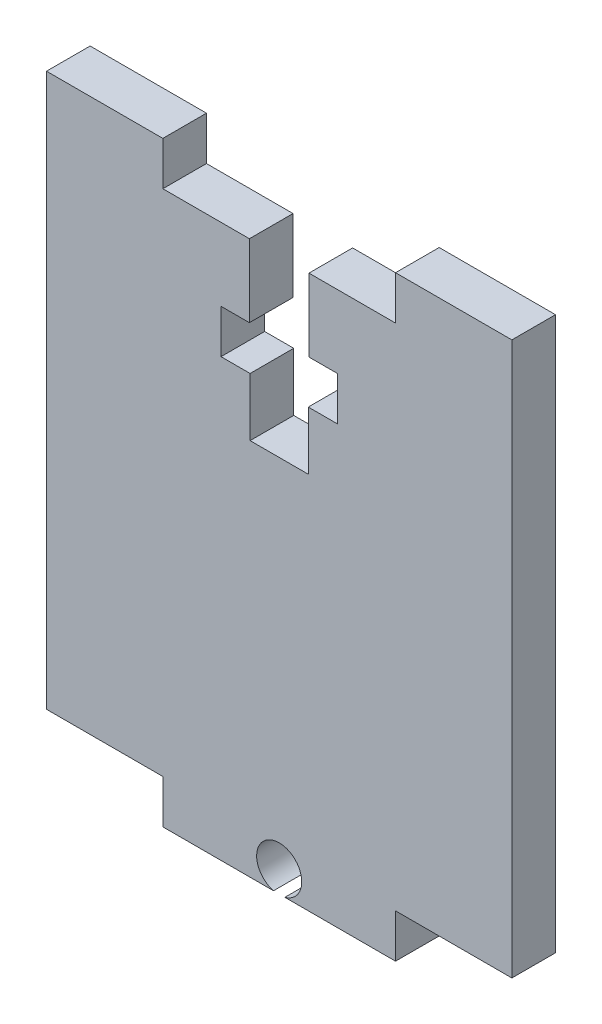
ISO-10303-21;
HEADER;
FILE_DESCRIPTION(('STEP AP214'),'2;1');
FILE_NAME('part.step','',(''),(''),'','','');
FILE_SCHEMA(('AUTOMOTIVE_DESIGN { 1 0 10303 214 1 1 1 1 }'));
ENDSEC;
DATA;
#1=APPLICATION_CONTEXT('core data for automotive mechanical design processes');
#2=APPLICATION_PROTOCOL_DEFINITION('international standard','automotive_design',2000,#1);
#3=PRODUCT_CONTEXT('',#1,'mechanical');
#4=PRODUCT('Part','Part','',(#3));
#5=PRODUCT_RELATED_PRODUCT_CATEGORY('part','',(#4));
#6=PRODUCT_DEFINITION_FORMATION('','',#4);
#7=PRODUCT_DEFINITION_CONTEXT('part definition',#1,'design');
#8=PRODUCT_DEFINITION('design','',#6,#7);
#9=PRODUCT_DEFINITION_SHAPE('','',#8);
#10=(LENGTH_UNIT() NAMED_UNIT(*) SI_UNIT(.MILLI.,.METRE.));
#11=(NAMED_UNIT(*) PLANE_ANGLE_UNIT() SI_UNIT($,.RADIAN.));
#12=(NAMED_UNIT(*) SI_UNIT($,.STERADIAN.) SOLID_ANGLE_UNIT());
#13=UNCERTAINTY_MEASURE_WITH_UNIT(LENGTH_MEASURE(1.E-05),#10,'distance_accuracy_value','');
#14=(GEOMETRIC_REPRESENTATION_CONTEXT(3) GLOBAL_UNCERTAINTY_ASSIGNED_CONTEXT((#13)) GLOBAL_UNIT_ASSIGNED_CONTEXT((#10,
#11,#12)) REPRESENTATION_CONTEXT('',''));
#15=CARTESIAN_POINT('',(0.,0.,0.));
#16=DIRECTION('',(0.,0.,1.));
#17=DIRECTION('',(1.,0.,0.));
#18=AXIS2_PLACEMENT_3D('',#15,#16,#17);
#19=CARTESIAN_POINT('',(8.,48.8553054771042,3.));
#20=DIRECTION('',(1.,0.,0.));
#21=DIRECTION('',(0.,0.,-1.));
#22=AXIS2_PLACEMENT_3D('',#19,#20,#21);
#23=PLANE('',#22);
#24=DIRECTION('',(0.,-1.,0.));
#25=VECTOR('',#24,1.);
#26=CARTESIAN_POINT('',(8.,48.8553054771042,0.));
#27=LINE('',#26,#25);
#28=CARTESIAN_POINT('',(8.,51.8553054771042,0.));
#29=VERTEX_POINT('',#28);
#30=CARTESIAN_POINT('',(8.,48.8553054771042,0.));
#31=VERTEX_POINT('',#30);
#32=EDGE_CURVE('E237',#29,#31,#27,.T.);
#33=ORIENTED_EDGE('',*,*,#32,.T.);
#34=DIRECTION('',(0.,0.,-1.));
#35=VECTOR('',#34,1.);
#36=CARTESIAN_POINT('',(8.,48.8553054771042,3.));
#37=LINE('',#36,#35);
#38=CARTESIAN_POINT('',(8.,48.8553054771042,3.));
#39=VERTEX_POINT('',#38);
#40=EDGE_CURVE('E11',#39,#31,#37,.T.);
#41=ORIENTED_EDGE('',*,*,#40,.F.);
#42=DIRECTION('',(0.,-1.,0.));
#43=VECTOR('',#42,1.);
#44=CARTESIAN_POINT('',(8.,48.8553054771042,3.));
#45=LINE('',#44,#43);
#46=CARTESIAN_POINT('',(8.,51.8553054771042,3.));
#47=VERTEX_POINT('',#46);
#48=EDGE_CURVE('E287',#47,#39,#45,.T.);
#49=ORIENTED_EDGE('',*,*,#48,.F.);
#50=DIRECTION('',(0.,0.,-1.));
#51=VECTOR('',#50,1.);
#52=CARTESIAN_POINT('',(8.,51.8553054771042,3.));
#53=LINE('',#52,#51);
#54=EDGE_CURVE('E233',#47,#29,#53,.T.);
#55=ORIENTED_EDGE('',*,*,#54,.T.);
#56=EDGE_LOOP('',(#33,#41,#49,#55));
#57=FACE_BOUND('',#56,.T.);
#58=ADVANCED_FACE('F33',(#57),#23,.F.);
#59=CARTESIAN_POINT('',(2.04789002341845,48.8553054771042,3.));
#60=DIRECTION('',(0.,-1.,0.));
#61=DIRECTION('',(0.,0.,-1.));
#62=AXIS2_PLACEMENT_3D('',#59,#60,#61);
#63=PLANE('',#62);
#64=DIRECTION('',(-1.,0.,0.));
#65=VECTOR('',#64,1.);
#66=CARTESIAN_POINT('',(2.04789002341845,48.8553054771042,0.));
#67=LINE('',#66,#65);
#68=CARTESIAN_POINT('',(2.04789002341845,48.8553054771042,0.));
#69=VERTEX_POINT('',#68);
#70=EDGE_CURVE('E240',#31,#69,#67,.T.);
#71=ORIENTED_EDGE('',*,*,#70,.T.);
#72=DIRECTION('',(0.,0.,-1.));
#73=VECTOR('',#72,1.);
#74=CARTESIAN_POINT('',(2.04789002341845,48.8553054771042,3.));
#75=LINE('',#74,#73);
#76=CARTESIAN_POINT('',(2.04789002341845,48.8553054771042,3.));
#77=VERTEX_POINT('',#76);
#78=EDGE_CURVE('E41',#77,#69,#75,.T.);
#79=ORIENTED_EDGE('',*,*,#78,.F.);
#80=DIRECTION('',(-1.,0.,0.));
#81=VECTOR('',#80,1.);
#82=CARTESIAN_POINT('',(2.04789002341845,48.8553054771042,3.));
#83=LINE('',#82,#81);
#84=EDGE_CURVE('E146',#39,#77,#83,.T.);
#85=ORIENTED_EDGE('',*,*,#84,.F.);
#86=ORIENTED_EDGE('',*,*,#40,.T.);
#87=EDGE_LOOP('',(#71,#79,#85,#86));
#88=FACE_BOUND('',#87,.T.);
#89=ADVANCED_FACE('F435',(#88),#63,.F.);
#90=CARTESIAN_POINT('',(2.04789002341845,48.8553054771042,3.));
#91=DIRECTION('',(1.,0.,0.));
#92=DIRECTION('',(0.,1.,0.));
#93=AXIS2_PLACEMENT_3D('',#90,#91,#92);
#94=PLANE('',#93);
#95=DIRECTION('',(0.,-1.,0.));
#96=VECTOR('',#95,1.);
#97=CARTESIAN_POINT('',(2.04789002341845,48.8553054771042,0.));
#98=LINE('',#97,#96);
#99=CARTESIAN_POINT('',(2.04789002341845,43.8553054771042,0.));
#100=VERTEX_POINT('',#99);
#101=EDGE_CURVE('E242',#69,#100,#98,.T.);
#102=ORIENTED_EDGE('',*,*,#101,.T.);
#103=DIRECTION('',(0.,0.,-1.));
#104=VECTOR('',#103,1.);
#105=CARTESIAN_POINT('',(2.04789002341845,43.8553054771042,3.));
#106=LINE('',#105,#104);
#107=CARTESIAN_POINT('',(2.04789002341845,43.8553054771042,3.));
#108=VERTEX_POINT('',#107);
#109=EDGE_CURVE('E348',#108,#100,#106,.T.);
#110=ORIENTED_EDGE('',*,*,#109,.F.);
#111=DIRECTION('',(0.,-1.,0.));
#112=VECTOR('',#111,1.);
#113=CARTESIAN_POINT('',(2.04789002341845,48.8553054771042,3.));
#114=LINE('',#113,#112);
#115=EDGE_CURVE('E356',#77,#108,#114,.T.);
#116=ORIENTED_EDGE('',*,*,#115,.F.);
#117=ORIENTED_EDGE('',*,*,#78,.T.);
#118=EDGE_LOOP('',(#102,#110,#116,#117));
#119=FACE_BOUND('',#118,.T.);
#120=ADVANCED_FACE('F354',(#119),#94,.F.);
#121=CARTESIAN_POINT('',(2.04789002341845,43.8553054771042,3.));
#122=DIRECTION('',(0.,1.,0.));
#123=DIRECTION('',(-1.,0.,0.));
#124=AXIS2_PLACEMENT_3D('',#121,#122,#123);
#125=PLANE('',#124);
#126=DIRECTION('',(1.,0.,0.));
#127=VECTOR('',#126,1.);
#128=CARTESIAN_POINT('',(2.04789002341845,43.8553054771042,0.));
#129=LINE('',#128,#127);
#130=CARTESIAN_POINT('',(4.,43.8553054771042,0.));
#131=VERTEX_POINT('',#130);
#132=EDGE_CURVE('E244',#100,#131,#129,.T.);
#133=ORIENTED_EDGE('',*,*,#132,.T.);
#134=DIRECTION('',(0.,0.,-1.));
#135=VECTOR('',#134,1.);
#136=CARTESIAN_POINT('',(4.,43.8553054771042,3.));
#137=LINE('',#136,#135);
#138=CARTESIAN_POINT('',(4.,43.8553054771042,3.));
#139=VERTEX_POINT('',#138);
#140=EDGE_CURVE('E345',#139,#131,#137,.T.);
#141=ORIENTED_EDGE('',*,*,#140,.F.);
#142=DIRECTION('',(1.,0.,0.));
#143=VECTOR('',#142,1.);
#144=CARTESIAN_POINT('',(2.04789002341845,43.8553054771042,3.));
#145=LINE('',#144,#143);
#146=EDGE_CURVE('E374',#108,#139,#145,.T.);
#147=ORIENTED_EDGE('',*,*,#146,.F.);
#148=ORIENTED_EDGE('',*,*,#109,.T.);
#149=EDGE_LOOP('',(#133,#141,#147,#148));
#150=FACE_BOUND('',#149,.T.);
#151=ADVANCED_FACE('F365',(#150),#125,.F.);
#152=CARTESIAN_POINT('',(4.,43.8553054771042,3.));
#153=DIRECTION('',(1.,0.,0.));
#154=DIRECTION('',(0.,1.,0.));
#155=AXIS2_PLACEMENT_3D('',#152,#153,#154);
#156=PLANE('',#155);
#157=DIRECTION('',(0.,-1.,0.));
#158=VECTOR('',#157,1.);
#159=CARTESIAN_POINT('',(4.,43.8553054771042,0.));
#160=LINE('',#159,#158);
#161=CARTESIAN_POINT('',(4.,40.8553054771042,0.));
#162=VERTEX_POINT('',#161);
#163=EDGE_CURVE('E246',#131,#162,#160,.T.);
#164=ORIENTED_EDGE('',*,*,#163,.T.);
#165=DIRECTION('',(0.,0.,-1.));
#166=VECTOR('',#165,1.);
#167=CARTESIAN_POINT('',(4.,40.8553054771042,3.));
#168=LINE('',#167,#166);
#169=CARTESIAN_POINT('',(4.,40.8553054771042,3.));
#170=VERTEX_POINT('',#169);
#171=EDGE_CURVE('E342',#170,#162,#168,.T.);
#172=ORIENTED_EDGE('',*,*,#171,.F.);
#173=DIRECTION('',(0.,-1.,0.));
#174=VECTOR('',#173,1.);
#175=CARTESIAN_POINT('',(4.,43.8553054771042,3.));
#176=LINE('',#175,#174);
#177=EDGE_CURVE('E371',#139,#170,#176,.T.);
#178=ORIENTED_EDGE('',*,*,#177,.F.);
#179=ORIENTED_EDGE('',*,*,#140,.T.);
#180=EDGE_LOOP('',(#164,#172,#178,#179));
#181=FACE_BOUND('',#180,.T.);
#182=ADVANCED_FACE('F369',(#181),#156,.F.);
#183=CARTESIAN_POINT('',(4.,40.8553054771042,3.));
#184=DIRECTION('',(0.,-1.,0.));
#185=DIRECTION('',(0.,0.,-1.));
#186=AXIS2_PLACEMENT_3D('',#183,#184,#185);
#187=PLANE('',#186);
#188=DIRECTION('',(-1.,0.,0.));
#189=VECTOR('',#188,1.);
#190=CARTESIAN_POINT('',(4.,40.8553054771042,0.));
#191=LINE('',#190,#189);
#192=CARTESIAN_POINT('',(2.,40.8553054771042,0.));
#193=VERTEX_POINT('',#192);
#194=EDGE_CURVE('E248',#162,#193,#191,.T.);
#195=ORIENTED_EDGE('',*,*,#194,.T.);
#196=DIRECTION('',(0.,0.,-1.));
#197=VECTOR('',#196,1.);
#198=CARTESIAN_POINT('',(2.,40.8553054771042,3.));
#199=LINE('',#198,#197);
#200=CARTESIAN_POINT('',(2.,40.8553054771042,3.));
#201=VERTEX_POINT('',#200);
#202=EDGE_CURVE('E339',#201,#193,#199,.T.);
#203=ORIENTED_EDGE('',*,*,#202,.F.);
#204=DIRECTION('',(-1.,0.,0.));
#205=VECTOR('',#204,1.);
#206=CARTESIAN_POINT('',(4.,40.8553054771042,3.));
#207=LINE('',#206,#205);
#208=EDGE_CURVE('E373',#170,#201,#207,.T.);
#209=ORIENTED_EDGE('',*,*,#208,.F.);
#210=ORIENTED_EDGE('',*,*,#171,.T.);
#211=EDGE_LOOP('',(#195,#203,#209,#210));
#212=FACE_BOUND('',#211,.T.);
#213=ADVANCED_FACE('F448',(#212),#187,.F.);
#214=CARTESIAN_POINT('',(2.,40.8553054771042,3.));
#215=DIRECTION('',(1.,0.,0.));
#216=DIRECTION('',(0.,1.,0.));
#217=AXIS2_PLACEMENT_3D('',#214,#215,#216);
#218=PLANE('',#217);
#219=DIRECTION('',(0.,-1.,0.));
#220=VECTOR('',#219,1.);
#221=CARTESIAN_POINT('',(2.,40.8553054771042,0.));
#222=LINE('',#221,#220);
#223=CARTESIAN_POINT('',(2.,36.8553054771042,0.));
#224=VERTEX_POINT('',#223);
#225=EDGE_CURVE('E250',#193,#224,#222,.T.);
#226=ORIENTED_EDGE('',*,*,#225,.T.);
#227=DIRECTION('',(0.,0.,-1.));
#228=VECTOR('',#227,1.);
#229=CARTESIAN_POINT('',(2.,36.8553054771042,3.));
#230=LINE('',#229,#228);
#231=CARTESIAN_POINT('',(2.,36.8553054771042,3.));
#232=VERTEX_POINT('',#231);
#233=EDGE_CURVE('E336',#232,#224,#230,.T.);
#234=ORIENTED_EDGE('',*,*,#233,.F.);
#235=DIRECTION('',(0.,-1.,0.));
#236=VECTOR('',#235,1.);
#237=CARTESIAN_POINT('',(2.,40.8553054771042,3.));
#238=LINE('',#237,#236);
#239=EDGE_CURVE('E376',#201,#232,#238,.T.);
#240=ORIENTED_EDGE('',*,*,#239,.F.);
#241=ORIENTED_EDGE('',*,*,#202,.T.);
#242=EDGE_LOOP('',(#226,#234,#240,#241));
#243=FACE_BOUND('',#242,.T.);
#244=ADVANCED_FACE('F451',(#243),#218,.F.);
#245=CARTESIAN_POINT('',(2.,36.8553054771042,3.));
#246=DIRECTION('',(0.,-1.,0.));
#247=DIRECTION('',(0.,0.,-1.));
#248=AXIS2_PLACEMENT_3D('',#245,#246,#247);
#249=PLANE('',#248);
#250=DIRECTION('',(-1.,0.,0.));
#251=VECTOR('',#250,1.);
#252=CARTESIAN_POINT('',(2.,36.8553054771042,0.));
#253=LINE('',#252,#251);
#254=CARTESIAN_POINT('',(-2.,36.8553054771042,0.));
#255=VERTEX_POINT('',#254);
#256=EDGE_CURVE('E252',#224,#255,#253,.T.);
#257=ORIENTED_EDGE('',*,*,#256,.T.);
#258=DIRECTION('',(0.,0.,-1.));
#259=VECTOR('',#258,1.);
#260=CARTESIAN_POINT('',(-2.,36.8553054771042,3.));
#261=LINE('',#260,#259);
#262=CARTESIAN_POINT('',(-2.,36.8553054771042,3.));
#263=VERTEX_POINT('',#262);
#264=EDGE_CURVE('E333',#263,#255,#261,.T.);
#265=ORIENTED_EDGE('',*,*,#264,.F.);
#266=DIRECTION('',(-1.,0.,0.));
#267=VECTOR('',#266,1.);
#268=CARTESIAN_POINT('',(2.,36.8553054771042,3.));
#269=LINE('',#268,#267);
#270=EDGE_CURVE('E382',#232,#263,#269,.T.);
#271=ORIENTED_EDGE('',*,*,#270,.F.);
#272=ORIENTED_EDGE('',*,*,#233,.T.);
#273=EDGE_LOOP('',(#257,#265,#271,#272));
#274=FACE_BOUND('',#273,.T.);
#275=ADVANCED_FACE('F455',(#274),#249,.F.);
#276=CARTESIAN_POINT('',(-2.,40.8553054771042,3.));
#277=DIRECTION('',(-1.,0.,0.));
#278=DIRECTION('',(0.,-1.,0.));
#279=AXIS2_PLACEMENT_3D('',#276,#277,#278);
#280=PLANE('',#279);
#281=DIRECTION('',(0.,1.,0.));
#282=VECTOR('',#281,1.);
#283=CARTESIAN_POINT('',(-2.,40.8553054771042,0.));
#284=LINE('',#283,#282);
#285=CARTESIAN_POINT('',(-2.,40.8553054771042,0.));
#286=VERTEX_POINT('',#285);
#287=EDGE_CURVE('E254',#255,#286,#284,.T.);
#288=ORIENTED_EDGE('',*,*,#287,.T.);
#289=DIRECTION('',(0.,0.,-1.));
#290=VECTOR('',#289,1.);
#291=CARTESIAN_POINT('',(-2.,40.8553054771042,3.));
#292=LINE('',#291,#290);
#293=CARTESIAN_POINT('',(-2.,40.8553054771042,3.));
#294=VERTEX_POINT('',#293);
#295=EDGE_CURVE('E330',#294,#286,#292,.T.);
#296=ORIENTED_EDGE('',*,*,#295,.F.);
#297=DIRECTION('',(0.,1.,0.));
#298=VECTOR('',#297,1.);
#299=CARTESIAN_POINT('',(-2.,40.8553054771042,3.));
#300=LINE('',#299,#298);
#301=EDGE_CURVE('E384',#263,#294,#300,.T.);
#302=ORIENTED_EDGE('',*,*,#301,.F.);
#303=ORIENTED_EDGE('',*,*,#264,.T.);
#304=EDGE_LOOP('',(#288,#296,#302,#303));
#305=FACE_BOUND('',#304,.T.);
#306=ADVANCED_FACE('F459',(#305),#280,.F.);
#307=CARTESIAN_POINT('',(-4.00000000000001,40.8553054771042,3.));
#308=DIRECTION('',(0.,-1.,0.));
#309=DIRECTION('',(0.,0.,-1.));
#310=AXIS2_PLACEMENT_3D('',#307,#308,#309);
#311=PLANE('',#310);
#312=DIRECTION('',(-1.,0.,0.));
#313=VECTOR('',#312,1.);
#314=CARTESIAN_POINT('',(-4.00000000000001,40.8553054771042,0.));
#315=LINE('',#314,#313);
#316=CARTESIAN_POINT('',(-4.00000000000001,40.8553054771042,0.));
#317=VERTEX_POINT('',#316);
#318=EDGE_CURVE('E256',#286,#317,#315,.T.);
#319=ORIENTED_EDGE('',*,*,#318,.T.);
#320=DIRECTION('',(0.,0.,-1.));
#321=VECTOR('',#320,1.);
#322=CARTESIAN_POINT('',(-4.00000000000001,40.8553054771042,3.));
#323=LINE('',#322,#321);
#324=CARTESIAN_POINT('',(-4.00000000000001,40.8553054771042,3.));
#325=VERTEX_POINT('',#324);
#326=EDGE_CURVE('E327',#325,#317,#323,.T.);
#327=ORIENTED_EDGE('',*,*,#326,.F.);
#328=DIRECTION('',(-1.,0.,0.));
#329=VECTOR('',#328,1.);
#330=CARTESIAN_POINT('',(-4.00000000000001,40.8553054771042,3.));
#331=LINE('',#330,#329);
#332=EDGE_CURVE('E386',#294,#325,#331,.T.);
#333=ORIENTED_EDGE('',*,*,#332,.F.);
#334=ORIENTED_EDGE('',*,*,#295,.T.);
#335=EDGE_LOOP('',(#319,#327,#333,#334));
#336=FACE_BOUND('',#335,.T.);
#337=ADVANCED_FACE('F463',(#336),#311,.F.);
#338=CARTESIAN_POINT('',(-4.,43.8553054771042,3.));
#339=DIRECTION('',(-1.,0.,0.));
#340=DIRECTION('',(0.,-1.,0.));
#341=AXIS2_PLACEMENT_3D('',#338,#339,#340);
#342=PLANE('',#341);
#343=DIRECTION('',(0.,1.,0.));
#344=VECTOR('',#343,1.);
#345=CARTESIAN_POINT('',(-4.,43.8553054771042,0.));
#346=LINE('',#345,#344);
#347=CARTESIAN_POINT('',(-4.,43.8553054771042,0.));
#348=VERTEX_POINT('',#347);
#349=EDGE_CURVE('E258',#317,#348,#346,.T.);
#350=ORIENTED_EDGE('',*,*,#349,.T.);
#351=DIRECTION('',(0.,0.,-1.));
#352=VECTOR('',#351,1.);
#353=CARTESIAN_POINT('',(-4.,43.8553054771042,3.));
#354=LINE('',#353,#352);
#355=CARTESIAN_POINT('',(-4.,43.8553054771042,3.));
#356=VERTEX_POINT('',#355);
#357=EDGE_CURVE('E324',#356,#348,#354,.T.);
#358=ORIENTED_EDGE('',*,*,#357,.F.);
#359=DIRECTION('',(0.,1.,0.));
#360=VECTOR('',#359,1.);
#361=CARTESIAN_POINT('',(-4.,43.8553054771042,3.));
#362=LINE('',#361,#360);
#363=EDGE_CURVE('E388',#325,#356,#362,.T.);
#364=ORIENTED_EDGE('',*,*,#363,.F.);
#365=ORIENTED_EDGE('',*,*,#326,.T.);
#366=EDGE_LOOP('',(#350,#358,#364,#365));
#367=FACE_BOUND('',#366,.T.);
#368=ADVANCED_FACE('F467',(#367),#342,.F.);
#369=CARTESIAN_POINT('',(-2.04789002341846,43.8553054771042,3.));
#370=DIRECTION('',(0.,1.,0.));
#371=DIRECTION('',(-1.,0.,0.));
#372=AXIS2_PLACEMENT_3D('',#369,#370,#371);
#373=PLANE('',#372);
#374=DIRECTION('',(1.,0.,0.));
#375=VECTOR('',#374,1.);
#376=CARTESIAN_POINT('',(-2.04789002341846,43.8553054771042,0.));
#377=LINE('',#376,#375);
#378=CARTESIAN_POINT('',(-2.04789002341846,43.8553054771042,0.));
#379=VERTEX_POINT('',#378);
#380=EDGE_CURVE('E260',#348,#379,#377,.T.);
#381=ORIENTED_EDGE('',*,*,#380,.T.);
#382=DIRECTION('',(0.,0.,-1.));
#383=VECTOR('',#382,1.);
#384=CARTESIAN_POINT('',(-2.04789002341846,43.8553054771042,3.));
#385=LINE('',#384,#383);
#386=CARTESIAN_POINT('',(-2.04789002341846,43.8553054771042,3.));
#387=VERTEX_POINT('',#386);
#388=EDGE_CURVE('E321',#387,#379,#385,.T.);
#389=ORIENTED_EDGE('',*,*,#388,.F.);
#390=DIRECTION('',(1.,0.,0.));
#391=VECTOR('',#390,1.);
#392=CARTESIAN_POINT('',(-2.04789002341846,43.8553054771042,3.));
#393=LINE('',#392,#391);
#394=EDGE_CURVE('E390',#356,#387,#393,.T.);
#395=ORIENTED_EDGE('',*,*,#394,.F.);
#396=ORIENTED_EDGE('',*,*,#357,.T.);
#397=EDGE_LOOP('',(#381,#389,#395,#396));
#398=FACE_BOUND('',#397,.T.);
#399=ADVANCED_FACE('F471',(#398),#373,.F.);
#400=CARTESIAN_POINT('',(-2.04789002341846,48.8553054771042,3.));
#401=DIRECTION('',(-1.,0.,0.));
#402=DIRECTION('',(0.,-1.,0.));
#403=AXIS2_PLACEMENT_3D('',#400,#401,#402);
#404=PLANE('',#403);
#405=DIRECTION('',(0.,1.,0.));
#406=VECTOR('',#405,1.);
#407=CARTESIAN_POINT('',(-2.04789002341846,48.8553054771042,0.));
#408=LINE('',#407,#406);
#409=CARTESIAN_POINT('',(-2.04789002341846,48.8553054771042,0.));
#410=VERTEX_POINT('',#409);
#411=EDGE_CURVE('E262',#379,#410,#408,.T.);
#412=ORIENTED_EDGE('',*,*,#411,.T.);
#413=DIRECTION('',(0.,0.,-1.));
#414=VECTOR('',#413,1.);
#415=CARTESIAN_POINT('',(-2.04789002341846,48.8553054771042,3.));
#416=LINE('',#415,#414);
#417=CARTESIAN_POINT('',(-2.04789002341846,48.8553054771042,3.));
#418=VERTEX_POINT('',#417);
#419=EDGE_CURVE('E318',#418,#410,#416,.T.);
#420=ORIENTED_EDGE('',*,*,#419,.F.);
#421=DIRECTION('',(0.,1.,0.));
#422=VECTOR('',#421,1.);
#423=CARTESIAN_POINT('',(-2.04789002341846,48.8553054771042,3.));
#424=LINE('',#423,#422);
#425=EDGE_CURVE('E392',#387,#418,#424,.T.);
#426=ORIENTED_EDGE('',*,*,#425,.F.);
#427=ORIENTED_EDGE('',*,*,#388,.T.);
#428=EDGE_LOOP('',(#412,#420,#426,#427));
#429=FACE_BOUND('',#428,.T.);
#430=ADVANCED_FACE('F475',(#429),#404,.F.);
#431=CARTESIAN_POINT('',(-2.04789002341846,48.8553054771042,3.));
#432=DIRECTION('',(0.,-1.,0.));
#433=DIRECTION('',(0.,0.,-1.));
#434=AXIS2_PLACEMENT_3D('',#431,#432,#433);
#435=PLANE('',#434);
#436=DIRECTION('',(-1.,0.,0.));
#437=VECTOR('',#436,1.);
#438=CARTESIAN_POINT('',(-2.04789002341846,48.8553054771042,0.));
#439=LINE('',#438,#437);
#440=CARTESIAN_POINT('',(-8.00000000000001,48.8553054771042,0.));
#441=VERTEX_POINT('',#440);
#442=EDGE_CURVE('E264',#410,#441,#439,.T.);
#443=ORIENTED_EDGE('',*,*,#442,.T.);
#444=DIRECTION('',(0.,0.,-1.));
#445=VECTOR('',#444,1.);
#446=CARTESIAN_POINT('',(-8.00000000000001,48.8553054771042,3.));
#447=LINE('',#446,#445);
#448=CARTESIAN_POINT('',(-8.00000000000001,48.8553054771042,3.));
#449=VERTEX_POINT('',#448);
#450=EDGE_CURVE('E315',#449,#441,#447,.T.);
#451=ORIENTED_EDGE('',*,*,#450,.F.);
#452=DIRECTION('',(-1.,0.,0.));
#453=VECTOR('',#452,1.);
#454=CARTESIAN_POINT('',(-2.04789002341846,48.8553054771042,3.));
#455=LINE('',#454,#453);
#456=EDGE_CURVE('E394',#418,#449,#455,.T.);
#457=ORIENTED_EDGE('',*,*,#456,.F.);
#458=ORIENTED_EDGE('',*,*,#419,.T.);
#459=EDGE_LOOP('',(#443,#451,#457,#458));
#460=FACE_BOUND('',#459,.T.);
#461=ADVANCED_FACE('F479',(#460),#435,.F.);
#462=CARTESIAN_POINT('',(-8.00000000000001,48.8553054771042,3.));
#463=DIRECTION('',(-1.,0.,0.));
#464=DIRECTION('',(0.,0.,1.));
#465=AXIS2_PLACEMENT_3D('',#462,#463,#464);
#466=PLANE('',#465);
#467=DIRECTION('',(0.,1.,0.));
#468=VECTOR('',#467,1.);
#469=CARTESIAN_POINT('',(-8.00000000000001,48.8553054771042,0.));
#470=LINE('',#469,#468);
#471=CARTESIAN_POINT('',(-8.00000000000001,51.8553054771042,0.));
#472=VERTEX_POINT('',#471);
#473=EDGE_CURVE('E266',#441,#472,#470,.T.);
#474=ORIENTED_EDGE('',*,*,#473,.T.);
#475=DIRECTION('',(0.,0.,-1.));
#476=VECTOR('',#475,1.);
#477=CARTESIAN_POINT('',(-8.00000000000001,51.8553054771042,3.));
#478=LINE('',#477,#476);
#479=CARTESIAN_POINT('',(-8.00000000000001,51.8553054771042,3.));
#480=VERTEX_POINT('',#479);
#481=EDGE_CURVE('E312',#480,#472,#478,.T.);
#482=ORIENTED_EDGE('',*,*,#481,.F.);
#483=DIRECTION('',(0.,1.,0.));
#484=VECTOR('',#483,1.);
#485=CARTESIAN_POINT('',(-8.00000000000001,48.8553054771042,3.));
#486=LINE('',#485,#484);
#487=EDGE_CURVE('E396',#449,#480,#486,.T.);
#488=ORIENTED_EDGE('',*,*,#487,.F.);
#489=ORIENTED_EDGE('',*,*,#450,.T.);
#490=EDGE_LOOP('',(#474,#482,#488,#489));
#491=FACE_BOUND('',#490,.T.);
#492=ADVANCED_FACE('F483',(#491),#466,.F.);
#493=CARTESIAN_POINT('',(-8.00000000000001,51.8553054771042,3.));
#494=DIRECTION('',(0.,-1.,0.));
#495=DIRECTION('',(0.,0.,-1.));
#496=AXIS2_PLACEMENT_3D('',#493,#494,#495);
#497=PLANE('',#496);
#498=DIRECTION('',(-1.,0.,0.));
#499=VECTOR('',#498,1.);
#500=CARTESIAN_POINT('',(-8.00000000000001,51.8553054771042,0.));
#501=LINE('',#500,#499);
#502=CARTESIAN_POINT('',(-16.,51.8553054771042,0.));
#503=VERTEX_POINT('',#502);
#504=EDGE_CURVE('E268',#472,#503,#501,.T.);
#505=ORIENTED_EDGE('',*,*,#504,.T.);
#506=DIRECTION('',(0.,0.,-1.));
#507=VECTOR('',#506,1.);
#508=CARTESIAN_POINT('',(-16.,51.8553054771042,3.));
#509=LINE('',#508,#507);
#510=CARTESIAN_POINT('',(-16.,51.8553054771042,3.));
#511=VERTEX_POINT('',#510);
#512=EDGE_CURVE('E309',#511,#503,#509,.T.);
#513=ORIENTED_EDGE('',*,*,#512,.F.);
#514=DIRECTION('',(-1.,0.,0.));
#515=VECTOR('',#514,1.);
#516=CARTESIAN_POINT('',(-8.00000000000001,51.8553054771042,3.));
#517=LINE('',#516,#515);
#518=EDGE_CURVE('E398',#480,#511,#517,.T.);
#519=ORIENTED_EDGE('',*,*,#518,.F.);
#520=ORIENTED_EDGE('',*,*,#481,.T.);
#521=EDGE_LOOP('',(#505,#513,#519,#520));
#522=FACE_BOUND('',#521,.T.);
#523=ADVANCED_FACE('F487',(#522),#497,.F.);
#524=CARTESIAN_POINT('',(-16.,51.8553054771042,3.));
#525=DIRECTION('',(1.,0.,0.));
#526=DIRECTION('',(0.,1.,0.));
#527=AXIS2_PLACEMENT_3D('',#524,#525,#526);
#528=PLANE('',#527);
#529=DIRECTION('',(0.,-1.,0.));
#530=VECTOR('',#529,1.);
#531=CARTESIAN_POINT('',(-16.,51.8553054771042,0.));
#532=LINE('',#531,#530);
#533=CARTESIAN_POINT('',(-16.,13.8553054771042,0.));
#534=VERTEX_POINT('',#533);
#535=EDGE_CURVE('E270',#503,#534,#532,.T.);
#536=ORIENTED_EDGE('',*,*,#535,.T.);
#537=DIRECTION('',(0.,0.,-1.));
#538=VECTOR('',#537,1.);
#539=CARTESIAN_POINT('',(-16.,13.8553054771042,3.));
#540=LINE('',#539,#538);
#541=CARTESIAN_POINT('',(-16.,13.8553054771042,3.));
#542=VERTEX_POINT('',#541);
#543=EDGE_CURVE('E306',#542,#534,#540,.T.);
#544=ORIENTED_EDGE('',*,*,#543,.F.);
#545=DIRECTION('',(0.,-1.,0.));
#546=VECTOR('',#545,1.);
#547=CARTESIAN_POINT('',(-16.,51.8553054771042,3.));
#548=LINE('',#547,#546);
#549=EDGE_CURVE('E400',#511,#542,#548,.T.);
#550=ORIENTED_EDGE('',*,*,#549,.F.);
#551=ORIENTED_EDGE('',*,*,#512,.T.);
#552=EDGE_LOOP('',(#536,#544,#550,#551));
#553=FACE_BOUND('',#552,.T.);
#554=ADVANCED_FACE('F491',(#553),#528,.F.);
#555=CARTESIAN_POINT('',(-16.,13.8553054771042,3.));
#556=DIRECTION('',(0.,1.,0.));
#557=DIRECTION('',(-1.,0.,0.));
#558=AXIS2_PLACEMENT_3D('',#555,#556,#557);
#559=PLANE('',#558);
#560=DIRECTION('',(1.,0.,0.));
#561=VECTOR('',#560,1.);
#562=CARTESIAN_POINT('',(-16.,13.8553054771042,0.));
#563=LINE('',#562,#561);
#564=CARTESIAN_POINT('',(-8.00000000000001,13.8553054771042,0.));
#565=VERTEX_POINT('',#564);
#566=EDGE_CURVE('E272',#534,#565,#563,.T.);
#567=ORIENTED_EDGE('',*,*,#566,.T.);
#568=DIRECTION('',(0.,0.,-1.));
#569=VECTOR('',#568,1.);
#570=CARTESIAN_POINT('',(-8.00000000000001,13.8553054771042,3.));
#571=LINE('',#570,#569);
#572=CARTESIAN_POINT('',(-8.00000000000001,13.8553054771042,3.));
#573=VERTEX_POINT('',#572);
#574=EDGE_CURVE('E303',#573,#565,#571,.T.);
#575=ORIENTED_EDGE('',*,*,#574,.F.);
#576=DIRECTION('',(1.,0.,0.));
#577=VECTOR('',#576,1.);
#578=CARTESIAN_POINT('',(-16.,13.8553054771042,3.));
#579=LINE('',#578,#577);
#580=EDGE_CURVE('E402',#542,#573,#579,.T.);
#581=ORIENTED_EDGE('',*,*,#580,.F.);
#582=ORIENTED_EDGE('',*,*,#543,.T.);
#583=EDGE_LOOP('',(#567,#575,#581,#582));
#584=FACE_BOUND('',#583,.T.);
#585=ADVANCED_FACE('F495',(#584),#559,.F.);
#586=CARTESIAN_POINT('',(-8.00000000000001,10.8553054771042,3.));
#587=DIRECTION('',(1.,0.,0.));
#588=DIRECTION('',(0.,1.,0.));
#589=AXIS2_PLACEMENT_3D('',#586,#587,#588);
#590=PLANE('',#589);
#591=DIRECTION('',(0.,-1.,0.));
#592=VECTOR('',#591,1.);
#593=CARTESIAN_POINT('',(-8.00000000000001,10.8553054771042,0.));
#594=LINE('',#593,#592);
#595=CARTESIAN_POINT('',(-8.00000000000001,10.8553054771042,0.));
#596=VERTEX_POINT('',#595);
#597=EDGE_CURVE('E274',#565,#596,#594,.T.);
#598=ORIENTED_EDGE('',*,*,#597,.T.);
#599=DIRECTION('',(0.,0.,-1.));
#600=VECTOR('',#599,1.);
#601=CARTESIAN_POINT('',(-8.00000000000001,10.8553054771042,3.));
#602=LINE('',#601,#600);
#603=CARTESIAN_POINT('',(-8.00000000000001,10.8553054771042,3.));
#604=VERTEX_POINT('',#603);
#605=EDGE_CURVE('E300',#604,#596,#602,.T.);
#606=ORIENTED_EDGE('',*,*,#605,.F.);
#607=DIRECTION('',(0.,-1.,0.));
#608=VECTOR('',#607,1.);
#609=CARTESIAN_POINT('',(-8.00000000000001,10.8553054771042,3.));
#610=LINE('',#609,#608);
#611=EDGE_CURVE('E404',#573,#604,#610,.T.);
#612=ORIENTED_EDGE('',*,*,#611,.F.);
#613=ORIENTED_EDGE('',*,*,#574,.T.);
#614=EDGE_LOOP('',(#598,#606,#612,#613));
#615=FACE_BOUND('',#614,.T.);
#616=ADVANCED_FACE('F499',(#615),#590,.F.);
#617=CARTESIAN_POINT('',(-8.00000000000001,10.8553054771042,3.));
#618=DIRECTION('',(0.,1.,0.));
#619=DIRECTION('',(-1.,0.,0.));
#620=AXIS2_PLACEMENT_3D('',#617,#618,#619);
#621=PLANE('',#620);
#622=DIRECTION('',(1.,0.,0.));
#623=VECTOR('',#622,1.);
#624=CARTESIAN_POINT('',(-8.00000000000001,10.8553054771042,0.));
#625=LINE('',#624,#623);
#626=CARTESIAN_POINT('',(-0.390512483795337,10.8553054771042,0.));
#627=VERTEX_POINT('',#626);
#628=EDGE_CURVE('E276',#596,#627,#625,.T.);
#629=ORIENTED_EDGE('',*,*,#628,.T.);
#630=DIRECTION('',(0.,0.,-1.));
#631=VECTOR('',#630,1.);
#632=CARTESIAN_POINT('',(-0.390512483795337,10.8553054771042,3.));
#633=LINE('',#632,#631);
#634=CARTESIAN_POINT('',(-0.390512483795337,10.8553054771042,3.));
#635=VERTEX_POINT('',#634);
#636=EDGE_CURVE('E297',#635,#627,#633,.T.);
#637=ORIENTED_EDGE('',*,*,#636,.F.);
#638=DIRECTION('',(1.,0.,0.));
#639=VECTOR('',#638,1.);
#640=CARTESIAN_POINT('',(-8.00000000000001,10.8553054771042,3.));
#641=LINE('',#640,#639);
#642=EDGE_CURVE('E406',#604,#635,#641,.T.);
#643=ORIENTED_EDGE('',*,*,#642,.F.);
#644=ORIENTED_EDGE('',*,*,#605,.T.);
#645=EDGE_LOOP('',(#629,#637,#643,#644));
#646=FACE_BOUND('',#645,.T.);
#647=ADVANCED_FACE('F503',(#646),#621,.F.);
#648=CARTESIAN_POINT('',(0.,12.3553054771042,3.));
#649=DIRECTION('',(0.,0.,-1.));
#650=DIRECTION('',(-1.,0.,0.));
#651=AXIS2_PLACEMENT_3D('',#648,#649,#650);
#652=CYLINDRICAL_SURFACE('',#651,1.55);
#653=CARTESIAN_POINT('',(0.,12.3553054771042,0.));
#654=DIRECTION('',(0.,0.,-1.));
#655=DIRECTION('',(1.,0.,0.));
#656=AXIS2_PLACEMENT_3D('',#653,#654,#655);
#657=CIRCLE('',#656,1.55);
#658=CARTESIAN_POINT('',(0.390512483795359,10.8553054771042,0.));
#659=VERTEX_POINT('',#658);
#660=EDGE_CURVE('E278',#627,#659,#657,.T.);
#661=ORIENTED_EDGE('',*,*,#660,.T.);
#662=DIRECTION('',(0.,0.,-1.));
#663=VECTOR('',#662,1.);
#664=CARTESIAN_POINT('',(0.390512483795359,10.8553054771042,3.));
#665=LINE('',#664,#663);
#666=CARTESIAN_POINT('',(0.390512483795359,10.8553054771042,3.));
#667=VERTEX_POINT('',#666);
#668=EDGE_CURVE('E294',#667,#659,#665,.T.);
#669=ORIENTED_EDGE('',*,*,#668,.F.);
#670=CARTESIAN_POINT('',(0.,12.3553054771042,3.));
#671=DIRECTION('',(0.,0.,-1.));
#672=DIRECTION('',(1.,0.,0.));
#673=AXIS2_PLACEMENT_3D('',#670,#671,#672);
#674=CIRCLE('',#673,1.55);
#675=EDGE_CURVE('E408',#635,#667,#674,.T.);
#676=ORIENTED_EDGE('',*,*,#675,.F.);
#677=ORIENTED_EDGE('',*,*,#636,.T.);
#678=EDGE_LOOP('',(#661,#669,#676,#677));
#679=FACE_BOUND('',#678,.T.);
#680=ADVANCED_FACE('F507',(#679),#652,.F.);
#681=CARTESIAN_POINT('',(0.39051248379536,10.8553054771042,3.));
#682=DIRECTION('',(0.,1.,0.));
#683=DIRECTION('',(0.,0.,1.));
#684=AXIS2_PLACEMENT_3D('',#681,#682,#683);
#685=PLANE('',#684);
#686=DIRECTION('',(1.,0.,0.));
#687=VECTOR('',#686,1.);
#688=CARTESIAN_POINT('',(0.39051248379536,10.8553054771042,0.));
#689=LINE('',#688,#687);
#690=CARTESIAN_POINT('',(8.00000000000003,10.8553054771042,0.));
#691=VERTEX_POINT('',#690);
#692=EDGE_CURVE('E280',#659,#691,#689,.T.);
#693=ORIENTED_EDGE('',*,*,#692,.T.);
#694=DIRECTION('',(0.,0.,-1.));
#695=VECTOR('',#694,1.);
#696=CARTESIAN_POINT('',(8.00000000000003,10.8553054771042,3.));
#697=LINE('',#696,#695);
#698=CARTESIAN_POINT('',(8.00000000000003,10.8553054771042,3.));
#699=VERTEX_POINT('',#698);
#700=EDGE_CURVE('E291',#699,#691,#697,.T.);
#701=ORIENTED_EDGE('',*,*,#700,.F.);
#702=DIRECTION('',(1.,0.,0.));
#703=VECTOR('',#702,1.);
#704=CARTESIAN_POINT('',(0.39051248379536,10.8553054771042,3.));
#705=LINE('',#704,#703);
#706=EDGE_CURVE('E410',#667,#699,#705,.T.);
#707=ORIENTED_EDGE('',*,*,#706,.F.);
#708=ORIENTED_EDGE('',*,*,#668,.T.);
#709=EDGE_LOOP('',(#693,#701,#707,#708));
#710=FACE_BOUND('',#709,.T.);
#711=ADVANCED_FACE('F416',(#710),#685,.F.);
#712=CARTESIAN_POINT('',(8.00000000000003,10.8553054771042,3.));
#713=DIRECTION('',(-1.,0.,0.));
#714=DIRECTION('',(0.,-1.,0.));
#715=AXIS2_PLACEMENT_3D('',#712,#713,#714);
#716=PLANE('',#715);
#717=DIRECTION('',(0.,1.,0.));
#718=VECTOR('',#717,1.);
#719=CARTESIAN_POINT('',(8.00000000000003,10.8553054771042,0.));
#720=LINE('',#719,#718);
#721=CARTESIAN_POINT('',(8.00000000000004,13.8553054771042,0.));
#722=VERTEX_POINT('',#721);
#723=EDGE_CURVE('E282',#691,#722,#720,.T.);
#724=ORIENTED_EDGE('',*,*,#723,.T.);
#725=DIRECTION('',(0.,0.,-1.));
#726=VECTOR('',#725,1.);
#727=CARTESIAN_POINT('',(8.00000000000004,13.8553054771042,3.));
#728=LINE('',#727,#726);
#729=CARTESIAN_POINT('',(8.00000000000004,13.8553054771042,3.));
#730=VERTEX_POINT('',#729);
#731=EDGE_CURVE('E228',#730,#722,#728,.T.);
#732=ORIENTED_EDGE('',*,*,#731,.F.);
#733=DIRECTION('',(0.,1.,0.));
#734=VECTOR('',#733,1.);
#735=CARTESIAN_POINT('',(8.00000000000003,10.8553054771042,3.));
#736=LINE('',#735,#734);
#737=EDGE_CURVE('E219',#699,#730,#736,.T.);
#738=ORIENTED_EDGE('',*,*,#737,.F.);
#739=ORIENTED_EDGE('',*,*,#700,.T.);
#740=EDGE_LOOP('',(#724,#732,#738,#739));
#741=FACE_BOUND('',#740,.T.);
#742=ADVANCED_FACE('F420',(#741),#716,.F.);
#743=CARTESIAN_POINT('',(16.,13.8553054771042,3.));
#744=DIRECTION('',(0.,1.,0.));
#745=DIRECTION('',(0.,0.,1.));
#746=AXIS2_PLACEMENT_3D('',#743,#744,#745);
#747=PLANE('',#746);
#748=DIRECTION('',(1.,0.,0.));
#749=VECTOR('',#748,1.);
#750=CARTESIAN_POINT('',(16.,13.8553054771042,0.));
#751=LINE('',#750,#749);
#752=CARTESIAN_POINT('',(16.,13.8553054771042,0.));
#753=VERTEX_POINT('',#752);
#754=EDGE_CURVE('E227',#722,#753,#751,.T.);
#755=ORIENTED_EDGE('',*,*,#754,.T.);
#756=DIRECTION('',(0.,0.,-1.));
#757=VECTOR('',#756,1.);
#758=CARTESIAN_POINT('',(16.,13.8553054771042,3.));
#759=LINE('',#758,#757);
#760=CARTESIAN_POINT('',(16.,13.8553054771042,3.));
#761=VERTEX_POINT('',#760);
#762=EDGE_CURVE('E224',#761,#753,#759,.T.);
#763=ORIENTED_EDGE('',*,*,#762,.F.);
#764=DIRECTION('',(1.,0.,0.));
#765=VECTOR('',#764,1.);
#766=CARTESIAN_POINT('',(16.,13.8553054771042,3.));
#767=LINE('',#766,#765);
#768=EDGE_CURVE('E213',#730,#761,#767,.T.);
#769=ORIENTED_EDGE('',*,*,#768,.F.);
#770=ORIENTED_EDGE('',*,*,#731,.T.);
#771=EDGE_LOOP('',(#755,#763,#769,#770));
#772=FACE_BOUND('',#771,.T.);
#773=ADVANCED_FACE('F225',(#772),#747,.F.);
#774=CARTESIAN_POINT('',(16.,51.8553054771042,3.));
#775=DIRECTION('',(-1.,0.,0.));
#776=DIRECTION('',(0.,-1.,0.));
#777=AXIS2_PLACEMENT_3D('',#774,#775,#776);
#778=PLANE('',#777);
#779=DIRECTION('',(0.,1.,0.));
#780=VECTOR('',#779,1.);
#781=CARTESIAN_POINT('',(16.,51.8553054771042,0.));
#782=LINE('',#781,#780);
#783=CARTESIAN_POINT('',(16.,51.8553054771042,0.));
#784=VERTEX_POINT('',#783);
#785=EDGE_CURVE('E132',#753,#784,#782,.T.);
#786=ORIENTED_EDGE('',*,*,#785,.T.);
#787=DIRECTION('',(0.,0.,-1.));
#788=VECTOR('',#787,1.);
#789=CARTESIAN_POINT('',(16.,51.8553054771042,3.));
#790=LINE('',#789,#788);
#791=CARTESIAN_POINT('',(16.,51.8553054771042,3.));
#792=VERTEX_POINT('',#791);
#793=EDGE_CURVE('E229',#792,#784,#790,.T.);
#794=ORIENTED_EDGE('',*,*,#793,.F.);
#795=DIRECTION('',(0.,1.,0.));
#796=VECTOR('',#795,1.);
#797=CARTESIAN_POINT('',(16.,51.8553054771042,3.));
#798=LINE('',#797,#796);
#799=EDGE_CURVE('E217',#761,#792,#798,.T.);
#800=ORIENTED_EDGE('',*,*,#799,.F.);
#801=ORIENTED_EDGE('',*,*,#762,.T.);
#802=EDGE_LOOP('',(#786,#794,#800,#801));
#803=FACE_BOUND('',#802,.T.);
#804=ADVANCED_FACE('F231',(#803),#778,.F.);
#805=CARTESIAN_POINT('',(8.,51.8553054771042,3.));
#806=DIRECTION('',(0.,-1.,0.));
#807=DIRECTION('',(0.,0.,-1.));
#808=AXIS2_PLACEMENT_3D('',#805,#806,#807);
#809=PLANE('',#808);
#810=DIRECTION('',(-1.,0.,0.));
#811=VECTOR('',#810,1.);
#812=CARTESIAN_POINT('',(8.,51.8553054771042,0.));
#813=LINE('',#812,#811);
#814=EDGE_CURVE('E138',#784,#29,#813,.T.);
#815=ORIENTED_EDGE('',*,*,#814,.T.);
#816=ORIENTED_EDGE('',*,*,#54,.F.);
#817=DIRECTION('',(-1.,0.,0.));
#818=VECTOR('',#817,1.);
#819=CARTESIAN_POINT('',(8.,51.8553054771042,3.));
#820=LINE('',#819,#818);
#821=EDGE_CURVE('E49',#792,#47,#820,.T.);
#822=ORIENTED_EDGE('',*,*,#821,.F.);
#823=ORIENTED_EDGE('',*,*,#793,.T.);
#824=EDGE_LOOP('',(#815,#816,#822,#823));
#825=FACE_BOUND('',#824,.T.);
#826=ADVANCED_FACE('F424',(#825),#809,.F.);
#827=CARTESIAN_POINT('',(0.,12.3553054771042,3.));
#828=DIRECTION('',(0.,0.,1.));
#829=DIRECTION('',(1.,0.,0.));
#830=AXIS2_PLACEMENT_3D('',#827,#828,#829);
#831=PLANE('',#830);
#832=ORIENTED_EDGE('',*,*,#48,.T.);
#833=ORIENTED_EDGE('',*,*,#84,.T.);
#834=ORIENTED_EDGE('',*,*,#115,.T.);
#835=ORIENTED_EDGE('',*,*,#146,.T.);
#836=ORIENTED_EDGE('',*,*,#177,.T.);
#837=ORIENTED_EDGE('',*,*,#208,.T.);
#838=ORIENTED_EDGE('',*,*,#239,.T.);
#839=ORIENTED_EDGE('',*,*,#270,.T.);
#840=ORIENTED_EDGE('',*,*,#301,.T.);
#841=ORIENTED_EDGE('',*,*,#332,.T.);
#842=ORIENTED_EDGE('',*,*,#363,.T.);
#843=ORIENTED_EDGE('',*,*,#394,.T.);
#844=ORIENTED_EDGE('',*,*,#425,.T.);
#845=ORIENTED_EDGE('',*,*,#456,.T.);
#846=ORIENTED_EDGE('',*,*,#487,.T.);
#847=ORIENTED_EDGE('',*,*,#518,.T.);
#848=ORIENTED_EDGE('',*,*,#549,.T.);
#849=ORIENTED_EDGE('',*,*,#580,.T.);
#850=ORIENTED_EDGE('',*,*,#611,.T.);
#851=ORIENTED_EDGE('',*,*,#642,.T.);
#852=ORIENTED_EDGE('',*,*,#675,.T.);
#853=ORIENTED_EDGE('',*,*,#706,.T.);
#854=ORIENTED_EDGE('',*,*,#737,.T.);
#855=ORIENTED_EDGE('',*,*,#768,.T.);
#856=ORIENTED_EDGE('',*,*,#799,.T.);
#857=ORIENTED_EDGE('',*,*,#821,.T.);
#858=EDGE_LOOP('',(#832,#833,#834,#835,#836,#837,#838,#839,#840,#841,#842,#843,#844,#845,#846,
#847,#848,#849,#850,#851,#852,#853,#854,#855,#856,#857));
#859=FACE_BOUND('',#858,.T.);
#860=ADVANCED_FACE('F215',(#859),#831,.T.);
#861=CARTESIAN_POINT('',(0.,12.3553054771042,0.));
#862=DIRECTION('',(0.,0.,1.));
#863=DIRECTION('',(1.,0.,0.));
#864=AXIS2_PLACEMENT_3D('',#861,#862,#863);
#865=PLANE('',#864);
#866=ORIENTED_EDGE('',*,*,#32,.F.);
#867=ORIENTED_EDGE('',*,*,#814,.F.);
#868=ORIENTED_EDGE('',*,*,#785,.F.);
#869=ORIENTED_EDGE('',*,*,#754,.F.);
#870=ORIENTED_EDGE('',*,*,#723,.F.);
#871=ORIENTED_EDGE('',*,*,#692,.F.);
#872=ORIENTED_EDGE('',*,*,#660,.F.);
#873=ORIENTED_EDGE('',*,*,#628,.F.);
#874=ORIENTED_EDGE('',*,*,#597,.F.);
#875=ORIENTED_EDGE('',*,*,#566,.F.);
#876=ORIENTED_EDGE('',*,*,#535,.F.);
#877=ORIENTED_EDGE('',*,*,#504,.F.);
#878=ORIENTED_EDGE('',*,*,#473,.F.);
#879=ORIENTED_EDGE('',*,*,#442,.F.);
#880=ORIENTED_EDGE('',*,*,#411,.F.);
#881=ORIENTED_EDGE('',*,*,#380,.F.);
#882=ORIENTED_EDGE('',*,*,#349,.F.);
#883=ORIENTED_EDGE('',*,*,#318,.F.);
#884=ORIENTED_EDGE('',*,*,#287,.F.);
#885=ORIENTED_EDGE('',*,*,#256,.F.);
#886=ORIENTED_EDGE('',*,*,#225,.F.);
#887=ORIENTED_EDGE('',*,*,#194,.F.);
#888=ORIENTED_EDGE('',*,*,#163,.F.);
#889=ORIENTED_EDGE('',*,*,#132,.F.);
#890=ORIENTED_EDGE('',*,*,#101,.F.);
#891=ORIENTED_EDGE('',*,*,#70,.F.);
#892=EDGE_LOOP('',(#866,#867,#868,#869,#870,#871,#872,#873,#874,#875,#876,#877,#878,#879,#880,
#881,#882,#883,#884,#885,#886,#887,#888,#889,#890,#891));
#893=FACE_BOUND('',#892,.T.);
#894=ADVANCED_FACE('F360',(#893),#865,.F.);
#895=CLOSED_SHELL('',(#58,#89,#120,#151,#182,#213,#244,#275,#306,#337,#368,#399,#430,#461,#492,
#523,#554,#585,#616,#647,#680,#711,#742,#773,#804,#826,#860,#894));
#896=MANIFOLD_SOLID_BREP('B2',#895);
#897=ADVANCED_BREP_SHAPE_REPRESENTATION('',(#18,#896),#14);
#898=SHAPE_DEFINITION_REPRESENTATION(#9,#897);
ENDSEC;
END-ISO-10303-21;
